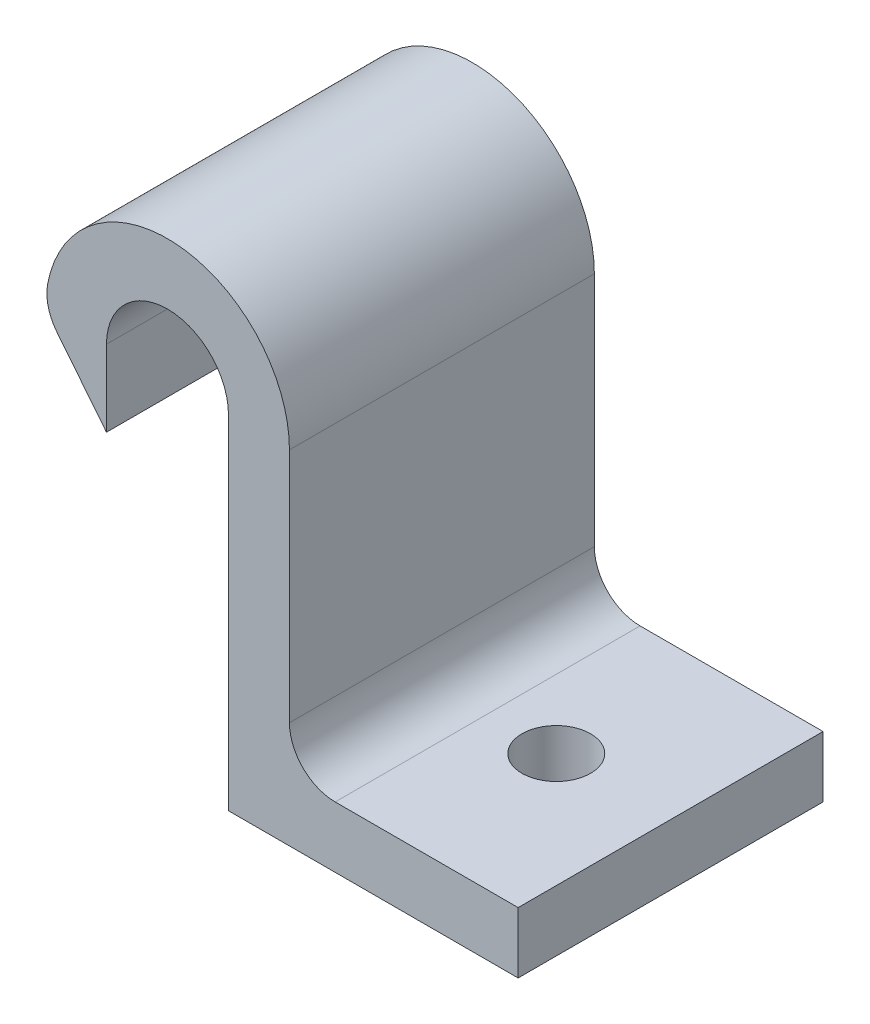
ISO-10303-21;
HEADER;
FILE_DESCRIPTION(('STEP AP214'),'2;1');
FILE_NAME('part.step','',(''),(''),'','','');
FILE_SCHEMA(('AUTOMOTIVE_DESIGN { 1 0 10303 214 1 1 1 1 }'));
ENDSEC;
DATA;
#1=APPLICATION_CONTEXT('core data for automotive mechanical design processes');
#2=APPLICATION_PROTOCOL_DEFINITION('international standard','automotive_design',2000,#1);
#3=PRODUCT_CONTEXT('',#1,'mechanical');
#4=PRODUCT('Part','Part','',(#3));
#5=PRODUCT_RELATED_PRODUCT_CATEGORY('part','',(#4));
#6=PRODUCT_DEFINITION_FORMATION('','',#4);
#7=PRODUCT_DEFINITION_CONTEXT('part definition',#1,'design');
#8=PRODUCT_DEFINITION('design','',#6,#7);
#9=PRODUCT_DEFINITION_SHAPE('','',#8);
#10=(LENGTH_UNIT() NAMED_UNIT(*) SI_UNIT(.MILLI.,.METRE.));
#11=(NAMED_UNIT(*) PLANE_ANGLE_UNIT() SI_UNIT($,.RADIAN.));
#12=(NAMED_UNIT(*) SI_UNIT($,.STERADIAN.) SOLID_ANGLE_UNIT());
#13=UNCERTAINTY_MEASURE_WITH_UNIT(LENGTH_MEASURE(1.E-05),#10,'distance_accuracy_value','');
#14=(GEOMETRIC_REPRESENTATION_CONTEXT(3) GLOBAL_UNCERTAINTY_ASSIGNED_CONTEXT((#13)) GLOBAL_UNIT_ASSIGNED_CONTEXT((#10,
#11,#12)) REPRESENTATION_CONTEXT('',''));
#15=CARTESIAN_POINT('',(0.,0.,0.));
#16=DIRECTION('',(0.,0.,1.));
#17=DIRECTION('',(1.,0.,0.));
#18=AXIS2_PLACEMENT_3D('',#15,#16,#17);
#19=CARTESIAN_POINT('',(0.,0.,20.));
#20=DIRECTION('',(0.,1.,0.));
#21=DIRECTION('',(0.,0.,1.));
#22=AXIS2_PLACEMENT_3D('',#19,#20,#21);
#23=PLANE('',#22);
#24=CARTESIAN_POINT('',(11.5,0.,10.));
#25=DIRECTION('',(0.,1.,0.));
#26=DIRECTION('',(-1.,0.,0.));
#27=AXIS2_PLACEMENT_3D('',#24,#25,#26);
#28=CIRCLE('',#27,2.25);
#29=CARTESIAN_POINT('',(9.25,0.,10.));
#30=VERTEX_POINT('',#29);
#31=EDGE_CURVE('E189',#30,#30,#28,.T.);
#32=ORIENTED_EDGE('',*,*,#31,.T.);
#33=EDGE_LOOP('',(#32));
#34=FACE_BOUND('',#33,.T.);
#35=DIRECTION('',(1.,0.,0.));
#36=VECTOR('',#35,1.);
#37=CARTESIAN_POINT('',(0.,0.,0.));
#38=LINE('',#37,#36);
#39=CARTESIAN_POINT('',(0.,0.,0.));
#40=VERTEX_POINT('',#39);
#41=CARTESIAN_POINT('',(19.,0.,0.));
#42=VERTEX_POINT('',#41);
#43=EDGE_CURVE('E138',#40,#42,#38,.T.);
#44=ORIENTED_EDGE('',*,*,#43,.T.);
#45=DIRECTION('',(0.,0.,-1.));
#46=VECTOR('',#45,1.);
#47=CARTESIAN_POINT('',(19.,0.,20.));
#48=LINE('',#47,#46);
#49=CARTESIAN_POINT('',(19.,0.,20.));
#50=VERTEX_POINT('',#49);
#51=EDGE_CURVE('E120',#50,#42,#48,.T.);
#52=ORIENTED_EDGE('',*,*,#51,.F.);
#53=DIRECTION('',(1.,0.,0.));
#54=VECTOR('',#53,1.);
#55=CARTESIAN_POINT('',(0.,0.,20.));
#56=LINE('',#55,#54);
#57=CARTESIAN_POINT('',(0.,0.,20.));
#58=VERTEX_POINT('',#57);
#59=EDGE_CURVE('E125',#58,#50,#56,.T.);
#60=ORIENTED_EDGE('',*,*,#59,.F.);
#61=DIRECTION('',(0.,0.,-1.));
#62=VECTOR('',#61,1.);
#63=CARTESIAN_POINT('',(0.,0.,20.));
#64=LINE('',#63,#62);
#65=EDGE_CURVE('E187',#58,#40,#64,.T.);
#66=ORIENTED_EDGE('',*,*,#65,.T.);
#67=EDGE_LOOP('',(#44,#52,#60,#66));
#68=FACE_BOUND('',#67,.T.);
#69=ADVANCED_FACE('F33',(#34,#68),#23,.F.);
#70=CARTESIAN_POINT('',(19.,0.,20.));
#71=DIRECTION('',(-1.,0.,0.));
#72=DIRECTION('',(0.,-1.,0.));
#73=AXIS2_PLACEMENT_3D('',#70,#71,#72);
#74=PLANE('',#73);
#75=DIRECTION('',(0.,1.,0.));
#76=VECTOR('',#75,1.);
#77=CARTESIAN_POINT('',(19.,0.,0.));
#78=LINE('',#77,#76);
#79=CARTESIAN_POINT('',(19.,4.,0.));
#80=VERTEX_POINT('',#79);
#81=EDGE_CURVE('E167',#42,#80,#78,.T.);
#82=ORIENTED_EDGE('',*,*,#81,.T.);
#83=DIRECTION('',(0.,0.,-1.));
#84=VECTOR('',#83,1.);
#85=CARTESIAN_POINT('',(19.,4.,20.));
#86=LINE('',#85,#84);
#87=CARTESIAN_POINT('',(19.,4.,20.));
#88=VERTEX_POINT('',#87);
#89=EDGE_CURVE('E123',#88,#80,#86,.T.);
#90=ORIENTED_EDGE('',*,*,#89,.F.);
#91=DIRECTION('',(0.,1.,0.));
#92=VECTOR('',#91,1.);
#93=CARTESIAN_POINT('',(19.,0.,20.));
#94=LINE('',#93,#92);
#95=EDGE_CURVE('E116',#50,#88,#94,.T.);
#96=ORIENTED_EDGE('',*,*,#95,.F.);
#97=ORIENTED_EDGE('',*,*,#51,.T.);
#98=EDGE_LOOP('',(#82,#90,#96,#97));
#99=FACE_BOUND('',#98,.T.);
#100=ADVANCED_FACE('F118',(#99),#74,.F.);
#101=CARTESIAN_POINT('',(19.,4.,20.));
#102=DIRECTION('',(0.,-1.,0.));
#103=DIRECTION('',(1.,0.,0.));
#104=AXIS2_PLACEMENT_3D('',#101,#102,#103);
#105=PLANE('',#104);
#106=CARTESIAN_POINT('',(11.5,4.,10.));
#107=DIRECTION('',(0.,1.,0.));
#108=DIRECTION('',(-1.,0.,0.));
#109=AXIS2_PLACEMENT_3D('',#106,#107,#108);
#110=CIRCLE('',#109,2.25);
#111=CARTESIAN_POINT('',(9.25,4.,10.));
#112=VERTEX_POINT('',#111);
#113=EDGE_CURVE('E268',#112,#112,#110,.T.);
#114=ORIENTED_EDGE('',*,*,#113,.F.);
#115=EDGE_LOOP('',(#114));
#116=FACE_BOUND('',#115,.T.);
#117=DIRECTION('',(-1.,0.,0.));
#118=VECTOR('',#117,1.);
#119=CARTESIAN_POINT('',(19.,4.,0.));
#120=LINE('',#119,#118);
#121=CARTESIAN_POINT('',(7.,4.,0.));
#122=VERTEX_POINT('',#121);
#123=EDGE_CURVE('E161',#80,#122,#120,.T.);
#124=ORIENTED_EDGE('',*,*,#123,.T.);
#125=DIRECTION('',(0.,0.,-1.));
#126=VECTOR('',#125,1.);
#127=CARTESIAN_POINT('',(7.,4.,20.));
#128=LINE('',#127,#126);
#129=CARTESIAN_POINT('',(7.,4.,20.));
#130=VERTEX_POINT('',#129);
#131=EDGE_CURVE('E54',#122,#130,#128,.F.);
#132=ORIENTED_EDGE('',*,*,#131,.T.);
#133=DIRECTION('',(-1.,0.,0.));
#134=VECTOR('',#133,1.);
#135=CARTESIAN_POINT('',(19.,4.,20.));
#136=LINE('',#135,#134);
#137=EDGE_CURVE('E124',#88,#130,#136,.T.);
#138=ORIENTED_EDGE('',*,*,#137,.F.);
#139=ORIENTED_EDGE('',*,*,#89,.T.);
#140=EDGE_LOOP('',(#124,#132,#138,#139));
#141=FACE_BOUND('',#140,.T.);
#142=ADVANCED_FACE('F166',(#116,#141),#105,.F.);
#143=CARTESIAN_POINT('',(4.,4.,20.));
#144=DIRECTION('',(-1.,0.,0.));
#145=DIRECTION('',(0.,0.,1.));
#146=AXIS2_PLACEMENT_3D('',#143,#144,#145);
#147=PLANE('',#146);
#148=DIRECTION('',(0.,1.,0.));
#149=VECTOR('',#148,1.);
#150=CARTESIAN_POINT('',(4.,4.,20.));
#151=LINE('',#150,#149);
#152=CARTESIAN_POINT('',(4.,7.,20.));
#153=VERTEX_POINT('',#152);
#154=CARTESIAN_POINT('',(4.,22.5,20.));
#155=VERTEX_POINT('',#154);
#156=EDGE_CURVE('E173',#153,#155,#151,.T.);
#157=ORIENTED_EDGE('',*,*,#156,.F.);
#158=DIRECTION('',(0.,0.,-1.));
#159=VECTOR('',#158,1.);
#160=CARTESIAN_POINT('',(4.,7.,0.));
#161=LINE('',#160,#159);
#162=CARTESIAN_POINT('',(4.,7.,0.));
#163=VERTEX_POINT('',#162);
#164=EDGE_CURVE('E153',#153,#163,#161,.T.);
#165=ORIENTED_EDGE('',*,*,#164,.T.);
#166=DIRECTION('',(0.,1.,0.));
#167=VECTOR('',#166,1.);
#168=CARTESIAN_POINT('',(4.,4.,0.));
#169=LINE('',#168,#167);
#170=CARTESIAN_POINT('',(4.,22.5,0.));
#171=VERTEX_POINT('',#170);
#172=EDGE_CURVE('E163',#163,#171,#169,.T.);
#173=ORIENTED_EDGE('',*,*,#172,.T.);
#174=DIRECTION('',(0.,0.,-1.));
#175=VECTOR('',#174,1.);
#176=CARTESIAN_POINT('',(4.,22.5,20.));
#177=LINE('',#176,#175);
#178=EDGE_CURVE('E144',#155,#171,#177,.T.);
#179=ORIENTED_EDGE('',*,*,#178,.F.);
#180=EDGE_LOOP('',(#157,#165,#173,#179));
#181=FACE_BOUND('',#180,.T.);
#182=ADVANCED_FACE('F170',(#181),#147,.F.);
#183=CARTESIAN_POINT('',(-4.,22.5,20.));
#184=DIRECTION('',(0.,0.,-1.));
#185=DIRECTION('',(-1.,0.,0.));
#186=AXIS2_PLACEMENT_3D('',#183,#184,#185);
#187=CYLINDRICAL_SURFACE('',#186,8.);
#188=CARTESIAN_POINT('',(-4.,22.5,0.));
#189=DIRECTION('',(0.,0.,1.));
#190=DIRECTION('',(1.,0.,0.));
#191=AXIS2_PLACEMENT_3D('',#188,#189,#190);
#192=CIRCLE('',#191,8.);
#193=CARTESIAN_POINT('',(-11.8571298339791,24.0051613773932,0.));
#194=VERTEX_POINT('',#193);
#195=EDGE_CURVE('E192',#171,#194,#192,.T.);
#196=ORIENTED_EDGE('',*,*,#195,.T.);
#197=DIRECTION('',(0.,0.,-1.));
#198=VECTOR('',#197,1.);
#199=CARTESIAN_POINT('',(-11.8571298339791,24.0051613773932,20.));
#200=LINE('',#199,#198);
#201=CARTESIAN_POINT('',(-11.8571298339791,24.0051613773932,20.));
#202=VERTEX_POINT('',#201);
#203=EDGE_CURVE('E149',#194,#202,#200,.F.);
#204=ORIENTED_EDGE('',*,*,#203,.T.);
#205=CARTESIAN_POINT('',(-4.,22.5,20.));
#206=DIRECTION('',(0.,0.,1.));
#207=DIRECTION('',(1.,0.,0.));
#208=AXIS2_PLACEMENT_3D('',#205,#206,#207);
#209=CIRCLE('',#208,8.);
#210=EDGE_CURVE('E175',#155,#202,#209,.T.);
#211=ORIENTED_EDGE('',*,*,#210,.F.);
#212=ORIENTED_EDGE('',*,*,#178,.T.);
#213=EDGE_LOOP('',(#196,#204,#211,#212));
#214=FACE_BOUND('',#213,.T.);
#215=ADVANCED_FACE('F212',(#214),#187,.T.);
#216=CARTESIAN_POINT('',(-12.,22.5,20.));
#217=DIRECTION('',(0.78086880944303,0.624695047554424,0.));
#218=DIRECTION('',(-0.624695047554424,0.78086880944303,0.));
#219=AXIS2_PLACEMENT_3D('',#216,#217,#218);
#220=PLANE('',#219);
#221=DIRECTION('',(0.624695047554424,-0.78086880944303,0.));
#222=VECTOR('',#221,1.);
#223=CARTESIAN_POINT('',(-12.,22.5,20.));
#224=LINE('',#223,#222);
#225=CARTESIAN_POINT('',(-11.253312574566,21.5666407182075,20.));
#226=VERTEX_POINT('',#225);
#227=CARTESIAN_POINT('',(-8.,17.5,20.));
#228=VERTEX_POINT('',#227);
#229=EDGE_CURVE('E177',#226,#228,#224,.T.);
#230=ORIENTED_EDGE('',*,*,#229,.F.);
#231=DIRECTION('',(0.,0.,-1.));
#232=VECTOR('',#231,1.);
#233=CARTESIAN_POINT('',(-11.253312574566,21.5666407182075,20.));
#234=LINE('',#233,#232);
#235=CARTESIAN_POINT('',(-11.253312574566,21.5666407182075,0.));
#236=VERTEX_POINT('',#235);
#237=EDGE_CURVE('E139',#226,#236,#234,.T.);
#238=ORIENTED_EDGE('',*,*,#237,.T.);
#239=DIRECTION('',(0.624695047554424,-0.78086880944303,0.));
#240=VECTOR('',#239,1.);
#241=CARTESIAN_POINT('',(-12.,22.5,0.));
#242=LINE('',#241,#240);
#243=CARTESIAN_POINT('',(-8.,17.5,0.));
#244=VERTEX_POINT('',#243);
#245=EDGE_CURVE('E195',#236,#244,#242,.T.);
#246=ORIENTED_EDGE('',*,*,#245,.T.);
#247=DIRECTION('',(0.,0.,-1.));
#248=VECTOR('',#247,1.);
#249=CARTESIAN_POINT('',(-8.,17.5,20.));
#250=LINE('',#249,#248);
#251=EDGE_CURVE('E209',#228,#244,#250,.T.);
#252=ORIENTED_EDGE('',*,*,#251,.F.);
#253=EDGE_LOOP('',(#230,#238,#246,#252));
#254=FACE_BOUND('',#253,.T.);
#255=ADVANCED_FACE('F221',(#254),#220,.F.);
#256=CARTESIAN_POINT('',(-8.,22.5,20.));
#257=DIRECTION('',(-1.,0.,0.));
#258=DIRECTION('',(0.,0.,1.));
#259=AXIS2_PLACEMENT_3D('',#256,#257,#258);
#260=PLANE('',#259);
#261=DIRECTION('',(0.,1.,0.));
#262=VECTOR('',#261,1.);
#263=CARTESIAN_POINT('',(-8.,22.5,0.));
#264=LINE('',#263,#262);
#265=CARTESIAN_POINT('',(-8.,22.5,0.));
#266=VERTEX_POINT('',#265);
#267=EDGE_CURVE('E197',#244,#266,#264,.T.);
#268=ORIENTED_EDGE('',*,*,#267,.T.);
#269=DIRECTION('',(0.,0.,-1.));
#270=VECTOR('',#269,1.);
#271=CARTESIAN_POINT('',(-8.,22.5,20.));
#272=LINE('',#271,#270);
#273=CARTESIAN_POINT('',(-8.,22.5,20.));
#274=VERTEX_POINT('',#273);
#275=EDGE_CURVE('E206',#274,#266,#272,.T.);
#276=ORIENTED_EDGE('',*,*,#275,.F.);
#277=DIRECTION('',(0.,1.,0.));
#278=VECTOR('',#277,1.);
#279=CARTESIAN_POINT('',(-8.,22.5,20.));
#280=LINE('',#279,#278);
#281=EDGE_CURVE('E182',#228,#274,#280,.T.);
#282=ORIENTED_EDGE('',*,*,#281,.F.);
#283=ORIENTED_EDGE('',*,*,#251,.T.);
#284=EDGE_LOOP('',(#268,#276,#282,#283));
#285=FACE_BOUND('',#284,.T.);
#286=ADVANCED_FACE('F228',(#285),#260,.F.);
#287=CARTESIAN_POINT('',(-4.,22.5,20.));
#288=DIRECTION('',(0.,0.,-1.));
#289=DIRECTION('',(-1.,0.,0.));
#290=AXIS2_PLACEMENT_3D('',#287,#288,#289);
#291=CYLINDRICAL_SURFACE('',#290,4.);
#292=CARTESIAN_POINT('',(-4.,22.5,0.));
#293=DIRECTION('',(0.,0.,-1.));
#294=DIRECTION('',(1.,0.,0.));
#295=AXIS2_PLACEMENT_3D('',#292,#293,#294);
#296=CIRCLE('',#295,4.);
#297=CARTESIAN_POINT('',(0.,22.5,0.));
#298=VERTEX_POINT('',#297);
#299=EDGE_CURVE('E199',#266,#298,#296,.T.);
#300=ORIENTED_EDGE('',*,*,#299,.T.);
#301=DIRECTION('',(0.,0.,-1.));
#302=VECTOR('',#301,1.);
#303=CARTESIAN_POINT('',(0.,22.5,20.));
#304=LINE('',#303,#302);
#305=CARTESIAN_POINT('',(0.,22.5,20.));
#306=VERTEX_POINT('',#305);
#307=EDGE_CURVE('E203',#306,#298,#304,.T.);
#308=ORIENTED_EDGE('',*,*,#307,.F.);
#309=CARTESIAN_POINT('',(-4.,22.5,20.));
#310=DIRECTION('',(0.,0.,-1.));
#311=DIRECTION('',(1.,0.,0.));
#312=AXIS2_PLACEMENT_3D('',#309,#310,#311);
#313=CIRCLE('',#312,4.);
#314=EDGE_CURVE('E184',#274,#306,#313,.T.);
#315=ORIENTED_EDGE('',*,*,#314,.F.);
#316=ORIENTED_EDGE('',*,*,#275,.T.);
#317=EDGE_LOOP('',(#300,#308,#315,#316));
#318=FACE_BOUND('',#317,.T.);
#319=ADVANCED_FACE('F231',(#318),#291,.F.);
#320=CARTESIAN_POINT('',(0.,0.,20.));
#321=DIRECTION('',(1.,0.,0.));
#322=DIRECTION('',(0.,0.,-1.));
#323=AXIS2_PLACEMENT_3D('',#320,#321,#322);
#324=PLANE('',#323);
#325=DIRECTION('',(0.,-1.,0.));
#326=VECTOR('',#325,1.);
#327=CARTESIAN_POINT('',(0.,0.,0.));
#328=LINE('',#327,#326);
#329=EDGE_CURVE('E135',#298,#40,#328,.T.);
#330=ORIENTED_EDGE('',*,*,#329,.T.);
#331=ORIENTED_EDGE('',*,*,#65,.F.);
#332=DIRECTION('',(0.,-1.,0.));
#333=VECTOR('',#332,1.);
#334=CARTESIAN_POINT('',(0.,0.,20.));
#335=LINE('',#334,#333);
#336=EDGE_CURVE('E131',#306,#58,#335,.T.);
#337=ORIENTED_EDGE('',*,*,#336,.F.);
#338=ORIENTED_EDGE('',*,*,#307,.T.);
#339=EDGE_LOOP('',(#330,#331,#337,#338));
#340=FACE_BOUND('',#339,.T.);
#341=ADVANCED_FACE('F234',(#340),#324,.F.);
#342=CARTESIAN_POINT('',(-4.,22.5,20.));
#343=DIRECTION('',(0.,0.,1.));
#344=DIRECTION('',(1.,0.,0.));
#345=AXIS2_PLACEMENT_3D('',#342,#343,#344);
#346=PLANE('',#345);
#347=ORIENTED_EDGE('',*,*,#210,.T.);
#348=CARTESIAN_POINT('',(-8.91070614623691,23.4407258608708,20.));
#349=DIRECTION('',(0.,0.,1.));
#350=DIRECTION('',(1.,0.,0.));
#351=AXIS2_PLACEMENT_3D('',#348,#349,#350);
#352=CIRCLE('',#351,3.);
#353=EDGE_CURVE('E151',#202,#226,#352,.T.);
#354=ORIENTED_EDGE('',*,*,#353,.T.);
#355=ORIENTED_EDGE('',*,*,#229,.T.);
#356=ORIENTED_EDGE('',*,*,#281,.T.);
#357=ORIENTED_EDGE('',*,*,#314,.T.);
#358=ORIENTED_EDGE('',*,*,#336,.T.);
#359=ORIENTED_EDGE('',*,*,#59,.T.);
#360=ORIENTED_EDGE('',*,*,#95,.T.);
#361=ORIENTED_EDGE('',*,*,#137,.T.);
#362=CARTESIAN_POINT('',(7.,7.,20.));
#363=DIRECTION('',(0.,0.,1.));
#364=DIRECTION('',(1.,0.,0.));
#365=AXIS2_PLACEMENT_3D('',#362,#363,#364);
#366=CIRCLE('',#365,3.);
#367=EDGE_CURVE('E11',#130,#153,#366,.F.);
#368=ORIENTED_EDGE('',*,*,#367,.T.);
#369=ORIENTED_EDGE('',*,*,#156,.T.);
#370=EDGE_LOOP('',(#347,#354,#355,#356,#357,#358,#359,#360,#361,#368,#369));
#371=FACE_BOUND('',#370,.T.);
#372=ADVANCED_FACE('F129',(#371),#346,.T.);
#373=CARTESIAN_POINT('',(-4.,22.5,0.));
#374=DIRECTION('',(0.,0.,1.));
#375=DIRECTION('',(1.,0.,0.));
#376=AXIS2_PLACEMENT_3D('',#373,#374,#375);
#377=PLANE('',#376);
#378=ORIENTED_EDGE('',*,*,#245,.F.);
#379=CARTESIAN_POINT('',(-8.91070614623691,23.4407258608708,0.));
#380=DIRECTION('',(0.,0.,1.));
#381=DIRECTION('',(1.,0.,0.));
#382=AXIS2_PLACEMENT_3D('',#379,#380,#381);
#383=CIRCLE('',#382,3.);
#384=EDGE_CURVE('E142',#236,#194,#383,.F.);
#385=ORIENTED_EDGE('',*,*,#384,.T.);
#386=ORIENTED_EDGE('',*,*,#195,.F.);
#387=ORIENTED_EDGE('',*,*,#172,.F.);
#388=CARTESIAN_POINT('',(7.,7.,0.));
#389=DIRECTION('',(0.,0.,1.));
#390=DIRECTION('',(1.,0.,0.));
#391=AXIS2_PLACEMENT_3D('',#388,#389,#390);
#392=CIRCLE('',#391,3.);
#393=EDGE_CURVE('E41',#163,#122,#392,.T.);
#394=ORIENTED_EDGE('',*,*,#393,.T.);
#395=ORIENTED_EDGE('',*,*,#123,.F.);
#396=ORIENTED_EDGE('',*,*,#81,.F.);
#397=ORIENTED_EDGE('',*,*,#43,.F.);
#398=ORIENTED_EDGE('',*,*,#329,.F.);
#399=ORIENTED_EDGE('',*,*,#299,.F.);
#400=ORIENTED_EDGE('',*,*,#267,.F.);
#401=EDGE_LOOP('',(#378,#385,#386,#387,#394,#395,#396,#397,#398,#399,#400));
#402=FACE_BOUND('',#401,.T.);
#403=ADVANCED_FACE('F160',(#402),#377,.F.);
#404=CARTESIAN_POINT('',(11.5,0.,10.));
#405=DIRECTION('',(0.,1.,0.));
#406=DIRECTION('',(-1.,0.,0.));
#407=AXIS2_PLACEMENT_3D('',#404,#405,#406);
#408=CYLINDRICAL_SURFACE('',#407,2.25);
#409=ORIENTED_EDGE('',*,*,#31,.F.);
#410=EDGE_LOOP('',(#409));
#411=FACE_BOUND('',#410,.T.);
#412=ORIENTED_EDGE('',*,*,#113,.T.);
#413=EDGE_LOOP('',(#412));
#414=FACE_BOUND('',#413,.T.);
#415=ADVANCED_FACE('F254',(#411,#414),#408,.F.);
#416=CARTESIAN_POINT('',(-8.91070614623691,23.4407258608708,20.));
#417=DIRECTION('',(0.,0.,-1.));
#418=DIRECTION('',(-1.,0.,0.));
#419=AXIS2_PLACEMENT_3D('',#416,#417,#418);
#420=CYLINDRICAL_SURFACE('',#419,3.);
#421=ORIENTED_EDGE('',*,*,#353,.F.);
#422=ORIENTED_EDGE('',*,*,#203,.F.);
#423=ORIENTED_EDGE('',*,*,#384,.F.);
#424=ORIENTED_EDGE('',*,*,#237,.F.);
#425=EDGE_LOOP('',(#421,#422,#423,#424));
#426=FACE_BOUND('',#425,.T.);
#427=ADVANCED_FACE('F218',(#426),#420,.T.);
#428=CARTESIAN_POINT('',(7.,7.,20.));
#429=DIRECTION('',(0.,0.,1.));
#430=DIRECTION('',(1.,0.,0.));
#431=AXIS2_PLACEMENT_3D('',#428,#429,#430);
#432=CYLINDRICAL_SURFACE('',#431,3.);
#433=ORIENTED_EDGE('',*,*,#367,.F.);
#434=ORIENTED_EDGE('',*,*,#131,.F.);
#435=ORIENTED_EDGE('',*,*,#393,.F.);
#436=ORIENTED_EDGE('',*,*,#164,.F.);
#437=EDGE_LOOP('',(#433,#434,#435,#436));
#438=FACE_BOUND('',#437,.T.);
#439=ADVANCED_FACE('F35',(#438),#432,.F.);
#440=CLOSED_SHELL('',(#69,#100,#142,#182,#215,#255,#286,#319,#341,#372,#403,#415,#427,#439));
#441=MANIFOLD_SOLID_BREP('B2',#440);
#442=ADVANCED_BREP_SHAPE_REPRESENTATION('',(#18,#441),#14);
#443=SHAPE_DEFINITION_REPRESENTATION(#9,#442);
ENDSEC;
END-ISO-10303-21;
